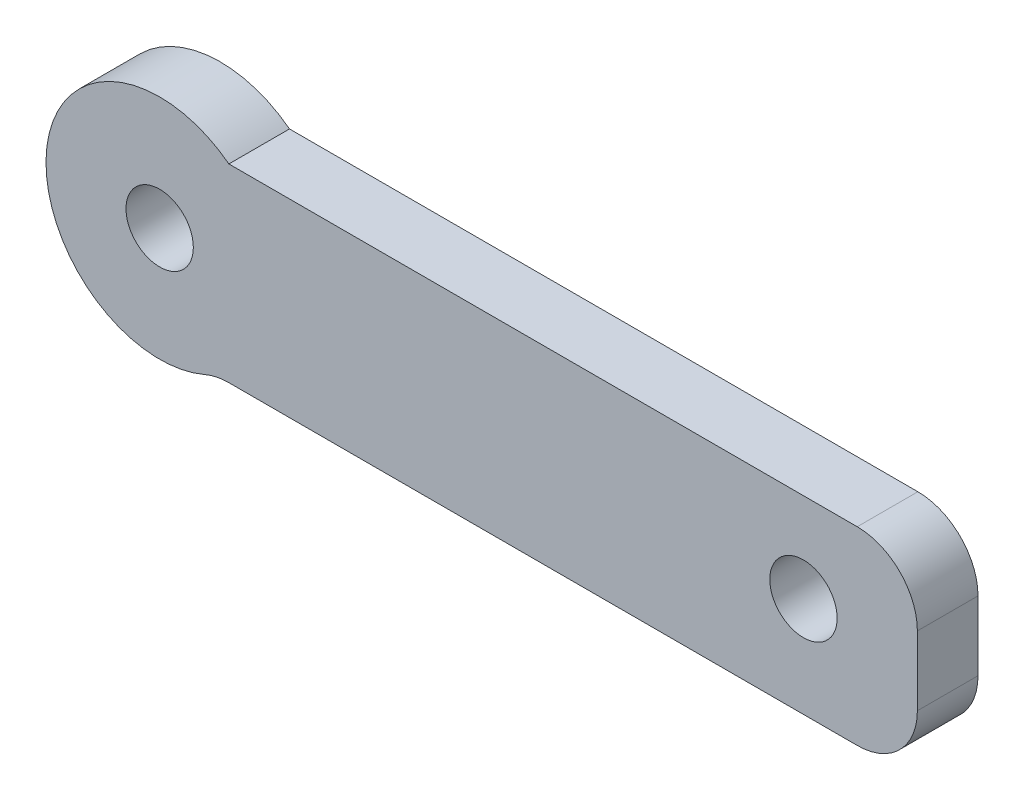
ISO-10303-21;
HEADER;
FILE_DESCRIPTION(('STEP AP214'),'2;1');
FILE_NAME('part.step','',(''),(''),'','','');
FILE_SCHEMA(('AUTOMOTIVE_DESIGN { 1 0 10303 214 1 1 1 1 }'));
ENDSEC;
DATA;
#1=APPLICATION_CONTEXT('core data for automotive mechanical design processes');
#2=APPLICATION_PROTOCOL_DEFINITION('international standard','automotive_design',2000,#1);
#3=PRODUCT_CONTEXT('',#1,'mechanical');
#4=PRODUCT('Part','Part','',(#3));
#5=PRODUCT_RELATED_PRODUCT_CATEGORY('part','',(#4));
#6=PRODUCT_DEFINITION_FORMATION('','',#4);
#7=PRODUCT_DEFINITION_CONTEXT('part definition',#1,'design');
#8=PRODUCT_DEFINITION('design','',#6,#7);
#9=PRODUCT_DEFINITION_SHAPE('','',#8);
#10=(LENGTH_UNIT() NAMED_UNIT(*) SI_UNIT(.MILLI.,.METRE.));
#11=(NAMED_UNIT(*) PLANE_ANGLE_UNIT() SI_UNIT($,.RADIAN.));
#12=(NAMED_UNIT(*) SI_UNIT($,.STERADIAN.) SOLID_ANGLE_UNIT());
#13=UNCERTAINTY_MEASURE_WITH_UNIT(LENGTH_MEASURE(1.E-05),#10,'distance_accuracy_value','');
#14=(GEOMETRIC_REPRESENTATION_CONTEXT(3) GLOBAL_UNCERTAINTY_ASSIGNED_CONTEXT((#13)) GLOBAL_UNIT_ASSIGNED_CONTEXT((#10,
#11,#12)) REPRESENTATION_CONTEXT('',''));
#15=CARTESIAN_POINT('',(0.,0.,0.));
#16=DIRECTION('',(0.,0.,1.));
#17=DIRECTION('',(1.,0.,0.));
#18=AXIS2_PLACEMENT_3D('',#15,#16,#17);
#19=CARTESIAN_POINT('',(1.82700523909868,-4.20799335863377,1.6002));
#20=DIRECTION('',(0.,0.,-1.));
#21=DIRECTION('',(-1.,0.,0.));
#22=AXIS2_PLACEMENT_3D('',#19,#20,#21);
#23=CYLINDRICAL_SURFACE('',#22,1.5875);
#24=CARTESIAN_POINT('',(1.82700523909868,-4.20799335863377,0.));
#25=DIRECTION('',(0.,0.,-1.));
#26=DIRECTION('',(1.,0.,0.));
#27=AXIS2_PLACEMENT_3D('',#24,#25,#26);
#28=CIRCLE('',#27,1.5875);
#29=CARTESIAN_POINT('',(1.19477181848415,-2.75182126995124,0.));
#30=VERTEX_POINT('',#29);
#31=CARTESIAN_POINT('',(1.82700523909868,-2.62049335863378,0.));
#32=VERTEX_POINT('',#31);
#33=EDGE_CURVE('E125',#30,#32,#28,.T.);
#34=ORIENTED_EDGE('',*,*,#33,.T.);
#35=DIRECTION('',(0.,0.,-1.));
#36=VECTOR('',#35,1.);
#37=CARTESIAN_POINT('',(1.82700523909868,-2.62049335863378,1.6002));
#38=LINE('',#37,#36);
#39=CARTESIAN_POINT('',(1.82700523909868,-2.62049335863378,1.6002));
#40=VERTEX_POINT('',#39);
#41=EDGE_CURVE('E11',#40,#32,#38,.T.);
#42=ORIENTED_EDGE('',*,*,#41,.F.);
#43=CARTESIAN_POINT('',(1.82700523909868,-4.20799335863377,1.6002));
#44=DIRECTION('',(0.,0.,-1.));
#45=DIRECTION('',(1.,0.,0.));
#46=AXIS2_PLACEMENT_3D('',#43,#44,#45);
#47=CIRCLE('',#46,1.5875);
#48=CARTESIAN_POINT('',(1.19477181848415,-2.75182126995124,1.6002));
#49=VERTEX_POINT('',#48);
#50=EDGE_CURVE('E137',#49,#40,#47,.T.);
#51=ORIENTED_EDGE('',*,*,#50,.F.);
#52=DIRECTION('',(0.,0.,-1.));
#53=VECTOR('',#52,1.);
#54=CARTESIAN_POINT('',(1.19477181848415,-2.75182126995124,1.6002));
#55=LINE('',#54,#53);
#56=EDGE_CURVE('E121',#49,#30,#55,.T.);
#57=ORIENTED_EDGE('',*,*,#56,.T.);
#58=EDGE_LOOP('',(#34,#42,#51,#57));
#59=FACE_BOUND('',#58,.T.);
#60=ADVANCED_FACE('F34',(#59),#23,.F.);
#61=CARTESIAN_POINT('',(1.82700523909868,-2.62049335863378,1.6002));
#62=DIRECTION('',(0.,1.,0.));
#63=DIRECTION('',(-1.,0.,0.));
#64=AXIS2_PLACEMENT_3D('',#61,#62,#63);
#65=PLANE('',#64);
#66=DIRECTION('',(1.,0.,0.));
#67=VECTOR('',#66,1.);
#68=CARTESIAN_POINT('',(1.82700523909868,-2.62049335863378,0.));
#69=LINE('',#68,#67);
#70=CARTESIAN_POINT('',(18.4125,-2.62049335863378,0.));
#71=VERTEX_POINT('',#70);
#72=EDGE_CURVE('E128',#32,#71,#69,.T.);
#73=ORIENTED_EDGE('',*,*,#72,.T.);
#74=DIRECTION('',(0.,0.,-1.));
#75=VECTOR('',#74,1.);
#76=CARTESIAN_POINT('',(18.4125,-2.62049335863378,1.6002));
#77=LINE('',#76,#75);
#78=CARTESIAN_POINT('',(18.4125,-2.62049335863378,1.6002));
#79=VERTEX_POINT('',#78);
#80=EDGE_CURVE('E43',#79,#71,#77,.T.);
#81=ORIENTED_EDGE('',*,*,#80,.F.);
#82=DIRECTION('',(1.,0.,0.));
#83=VECTOR('',#82,1.);
#84=CARTESIAN_POINT('',(1.82700523909868,-2.62049335863378,1.6002));
#85=LINE('',#84,#83);
#86=EDGE_CURVE('E91',#40,#79,#85,.T.);
#87=ORIENTED_EDGE('',*,*,#86,.F.);
#88=ORIENTED_EDGE('',*,*,#41,.T.);
#89=EDGE_LOOP('',(#73,#81,#87,#88));
#90=FACE_BOUND('',#89,.T.);
#91=ADVANCED_FACE('F190',(#90),#65,.F.);
#92=CARTESIAN_POINT('',(18.4125,-1.03299335863378,1.6002));
#93=DIRECTION('',(0.,0.,-1.));
#94=DIRECTION('',(-1.,0.,0.));
#95=AXIS2_PLACEMENT_3D('',#92,#93,#94);
#96=CYLINDRICAL_SURFACE('',#95,1.5875);
#97=CARTESIAN_POINT('',(18.4125,-1.03299335863378,0.));
#98=DIRECTION('',(0.,0.,1.));
#99=DIRECTION('',(1.,0.,0.));
#100=AXIS2_PLACEMENT_3D('',#97,#98,#99);
#101=CIRCLE('',#100,1.5875);
#102=CARTESIAN_POINT('',(20.,-1.03299335863378,0.));
#103=VERTEX_POINT('',#102);
#104=EDGE_CURVE('E130',#71,#103,#101,.T.);
#105=ORIENTED_EDGE('',*,*,#104,.T.);
#106=DIRECTION('',(0.,0.,-1.));
#107=VECTOR('',#106,1.);
#108=CARTESIAN_POINT('',(20.,-1.03299335863378,1.6002));
#109=LINE('',#108,#107);
#110=CARTESIAN_POINT('',(20.,-1.03299335863378,1.6002));
#111=VERTEX_POINT('',#110);
#112=EDGE_CURVE('E141',#111,#103,#109,.T.);
#113=ORIENTED_EDGE('',*,*,#112,.F.);
#114=CARTESIAN_POINT('',(18.4125,-1.03299335863378,1.6002));
#115=DIRECTION('',(0.,0.,1.));
#116=DIRECTION('',(1.,0.,0.));
#117=AXIS2_PLACEMENT_3D('',#114,#115,#116);
#118=CIRCLE('',#117,1.5875);
#119=EDGE_CURVE('E150',#79,#111,#118,.T.);
#120=ORIENTED_EDGE('',*,*,#119,.F.);
#121=ORIENTED_EDGE('',*,*,#80,.T.);
#122=EDGE_LOOP('',(#105,#113,#120,#121));
#123=FACE_BOUND('',#122,.T.);
#124=ADVANCED_FACE('F148',(#123),#96,.T.);
#125=CARTESIAN_POINT('',(20.,-1.03299335863378,1.6002));
#126=DIRECTION('',(-1.,0.,0.));
#127=DIRECTION('',(0.,-1.,0.));
#128=AXIS2_PLACEMENT_3D('',#125,#126,#127);
#129=PLANE('',#128);
#130=DIRECTION('',(0.,1.,0.));
#131=VECTOR('',#130,1.);
#132=CARTESIAN_POINT('',(20.,-1.03299335863378,0.));
#133=LINE('',#132,#131);
#134=CARTESIAN_POINT('',(20.,0.792006641366224,0.));
#135=VERTEX_POINT('',#134);
#136=EDGE_CURVE('E132',#103,#135,#133,.T.);
#137=ORIENTED_EDGE('',*,*,#136,.T.);
#138=DIRECTION('',(0.,0.,-1.));
#139=VECTOR('',#138,1.);
#140=CARTESIAN_POINT('',(20.,0.792006641366224,1.6002));
#141=LINE('',#140,#139);
#142=CARTESIAN_POINT('',(20.,0.792006641366224,1.6002));
#143=VERTEX_POINT('',#142);
#144=EDGE_CURVE('E116',#143,#135,#141,.T.);
#145=ORIENTED_EDGE('',*,*,#144,.F.);
#146=DIRECTION('',(0.,1.,0.));
#147=VECTOR('',#146,1.);
#148=CARTESIAN_POINT('',(20.,-1.03299335863378,1.6002));
#149=LINE('',#148,#147);
#150=EDGE_CURVE('E107',#111,#143,#149,.T.);
#151=ORIENTED_EDGE('',*,*,#150,.F.);
#152=ORIENTED_EDGE('',*,*,#112,.T.);
#153=EDGE_LOOP('',(#137,#145,#151,#152));
#154=FACE_BOUND('',#153,.T.);
#155=ADVANCED_FACE('F156',(#154),#129,.F.);
#156=CARTESIAN_POINT('',(18.4125,0.792006641366224,1.6002));
#157=DIRECTION('',(0.,0.,-1.));
#158=DIRECTION('',(-1.,0.,0.));
#159=AXIS2_PLACEMENT_3D('',#156,#157,#158);
#160=CYLINDRICAL_SURFACE('',#159,1.5875);
#161=CARTESIAN_POINT('',(18.4125,0.792006641366224,0.));
#162=DIRECTION('',(0.,0.,1.));
#163=DIRECTION('',(-1.,0.,0.));
#164=AXIS2_PLACEMENT_3D('',#161,#162,#163);
#165=CIRCLE('',#164,1.5875);
#166=CARTESIAN_POINT('',(18.4125,2.37950664136623,0.));
#167=VERTEX_POINT('',#166);
#168=EDGE_CURVE('E115',#135,#167,#165,.T.);
#169=ORIENTED_EDGE('',*,*,#168,.T.);
#170=DIRECTION('',(0.,0.,-1.));
#171=VECTOR('',#170,1.);
#172=CARTESIAN_POINT('',(18.4125,2.37950664136623,1.6002));
#173=LINE('',#172,#171);
#174=CARTESIAN_POINT('',(18.4125,2.37950664136623,1.6002));
#175=VERTEX_POINT('',#174);
#176=EDGE_CURVE('E112',#175,#167,#173,.T.);
#177=ORIENTED_EDGE('',*,*,#176,.F.);
#178=CARTESIAN_POINT('',(18.4125,0.792006641366224,1.6002));
#179=DIRECTION('',(0.,0.,1.));
#180=DIRECTION('',(-1.,0.,0.));
#181=AXIS2_PLACEMENT_3D('',#178,#179,#180);
#182=CIRCLE('',#181,1.5875);
#183=EDGE_CURVE('E101',#143,#175,#182,.T.);
#184=ORIENTED_EDGE('',*,*,#183,.F.);
#185=ORIENTED_EDGE('',*,*,#144,.T.);
#186=EDGE_LOOP('',(#169,#177,#184,#185));
#187=FACE_BOUND('',#186,.T.);
#188=ADVANCED_FACE('F113',(#187),#160,.T.);
#189=CARTESIAN_POINT('',(1.82700523909868,2.37950664136622,1.6002));
#190=DIRECTION('',(0.,-1.,0.));
#191=DIRECTION('',(1.,0.,0.));
#192=AXIS2_PLACEMENT_3D('',#189,#190,#191);
#193=PLANE('',#192);
#194=DIRECTION('',(-1.,0.,0.));
#195=VECTOR('',#194,1.);
#196=CARTESIAN_POINT('',(1.82700523909868,2.37950664136622,0.));
#197=LINE('',#196,#195);
#198=CARTESIAN_POINT('',(1.82700523909868,2.37950664136622,0.));
#199=VERTEX_POINT('',#198);
#200=EDGE_CURVE('E77',#167,#199,#197,.T.);
#201=ORIENTED_EDGE('',*,*,#200,.T.);
#202=DIRECTION('',(0.,0.,-1.));
#203=VECTOR('',#202,1.);
#204=CARTESIAN_POINT('',(1.82700523909868,2.37950664136622,1.6002));
#205=LINE('',#204,#203);
#206=CARTESIAN_POINT('',(1.82700523909868,2.37950664136622,1.6002));
#207=VERTEX_POINT('',#206);
#208=EDGE_CURVE('E117',#207,#199,#205,.T.);
#209=ORIENTED_EDGE('',*,*,#208,.F.);
#210=DIRECTION('',(-1.,0.,0.));
#211=VECTOR('',#210,1.);
#212=CARTESIAN_POINT('',(1.82700523909868,2.37950664136622,1.6002));
#213=LINE('',#212,#211);
#214=EDGE_CURVE('E105',#175,#207,#213,.T.);
#215=ORIENTED_EDGE('',*,*,#214,.F.);
#216=ORIENTED_EDGE('',*,*,#176,.T.);
#217=EDGE_LOOP('',(#201,#209,#215,#216));
#218=FACE_BOUND('',#217,.T.);
#219=ADVANCED_FACE('F119',(#218),#193,.F.);
#220=CARTESIAN_POINT('',(0.,0.,1.6002));
#221=DIRECTION('',(0.,0.,-1.));
#222=DIRECTION('',(-1.,0.,0.));
#223=AXIS2_PLACEMENT_3D('',#220,#221,#222);
#224=CYLINDRICAL_SURFACE('',#223,3.);
#225=CARTESIAN_POINT('',(0.,0.,0.));
#226=DIRECTION('',(0.,0.,1.));
#227=DIRECTION('',(1.,0.,0.));
#228=AXIS2_PLACEMENT_3D('',#225,#226,#227);
#229=CIRCLE('',#228,3.);
#230=EDGE_CURVE('E83',#199,#30,#229,.T.);
#231=ORIENTED_EDGE('',*,*,#230,.T.);
#232=ORIENTED_EDGE('',*,*,#56,.F.);
#233=CARTESIAN_POINT('',(0.,0.,1.6002));
#234=DIRECTION('',(0.,0.,1.));
#235=DIRECTION('',(1.,0.,0.));
#236=AXIS2_PLACEMENT_3D('',#233,#234,#235);
#237=CIRCLE('',#236,3.);
#238=EDGE_CURVE('E51',#207,#49,#237,.T.);
#239=ORIENTED_EDGE('',*,*,#238,.F.);
#240=ORIENTED_EDGE('',*,*,#208,.T.);
#241=EDGE_LOOP('',(#231,#232,#239,#240));
#242=FACE_BOUND('',#241,.T.);
#243=ADVANCED_FACE('F197',(#242),#224,.T.);
#244=CARTESIAN_POINT('',(1.82700523909868,-4.20799335863377,1.6002));
#245=DIRECTION('',(0.,0.,1.));
#246=DIRECTION('',(1.,0.,0.));
#247=AXIS2_PLACEMENT_3D('',#244,#245,#246);
#248=PLANE('',#247);
#249=CARTESIAN_POINT('',(16.9932188340461,0.0226560855687182,1.6002));
#250=DIRECTION('',(0.,0.,1.));
#251=DIRECTION('',(1.,0.,0.));
#252=AXIS2_PLACEMENT_3D('',#249,#250,#251);
#253=CIRCLE('',#252,0.888999999999914);
#254=CARTESIAN_POINT('',(17.882218834046,0.0226560855687182,1.6002));
#255=VERTEX_POINT('',#254);
#256=EDGE_CURVE('E164',#255,#255,#253,.T.);
#257=ORIENTED_EDGE('',*,*,#256,.F.);
#258=EDGE_LOOP('',(#257));
#259=FACE_BOUND('',#258,.T.);
#260=CARTESIAN_POINT('',(0.,0.,1.6002));
#261=DIRECTION('',(0.,0.,1.));
#262=DIRECTION('',(1.,0.,0.));
#263=AXIS2_PLACEMENT_3D('',#260,#261,#262);
#264=CIRCLE('',#263,0.888999999999943);
#265=CARTESIAN_POINT('',(0.888999999999943,0.,1.6002));
#266=VERTEX_POINT('',#265);
#267=EDGE_CURVE('E161',#266,#266,#264,.T.);
#268=ORIENTED_EDGE('',*,*,#267,.F.);
#269=EDGE_LOOP('',(#268));
#270=FACE_BOUND('',#269,.T.);
#271=ORIENTED_EDGE('',*,*,#50,.T.);
#272=ORIENTED_EDGE('',*,*,#86,.T.);
#273=ORIENTED_EDGE('',*,*,#119,.T.);
#274=ORIENTED_EDGE('',*,*,#150,.T.);
#275=ORIENTED_EDGE('',*,*,#183,.T.);
#276=ORIENTED_EDGE('',*,*,#214,.T.);
#277=ORIENTED_EDGE('',*,*,#238,.T.);
#278=EDGE_LOOP('',(#271,#272,#273,#274,#275,#276,#277));
#279=FACE_BOUND('',#278,.T.);
#280=ADVANCED_FACE('F103',(#259,#270,#279),#248,.T.);
#281=CARTESIAN_POINT('',(1.82700523909868,-4.20799335863377,0.));
#282=DIRECTION('',(0.,0.,1.));
#283=DIRECTION('',(1.,0.,0.));
#284=AXIS2_PLACEMENT_3D('',#281,#282,#283);
#285=PLANE('',#284);
#286=CARTESIAN_POINT('',(16.9932188340461,0.0226560855687182,0.));
#287=DIRECTION('',(0.,0.,-1.));
#288=DIRECTION('',(-1.,0.,0.));
#289=AXIS2_PLACEMENT_3D('',#286,#287,#288);
#290=CIRCLE('',#289,0.888999999999942);
#291=CARTESIAN_POINT('',(16.1042188340462,0.0226560855687182,0.));
#292=VERTEX_POINT('',#291);
#293=EDGE_CURVE('E167',#292,#292,#290,.T.);
#294=ORIENTED_EDGE('',*,*,#293,.F.);
#295=EDGE_LOOP('',(#294));
#296=FACE_BOUND('',#295,.T.);
#297=CARTESIAN_POINT('',(0.,0.,0.));
#298=DIRECTION('',(0.,0.,1.));
#299=DIRECTION('',(1.,0.,0.));
#300=AXIS2_PLACEMENT_3D('',#297,#298,#299);
#301=CIRCLE('',#300,0.888999999999914);
#302=CARTESIAN_POINT('',(0.888999999999914,0.,0.));
#303=VERTEX_POINT('',#302);
#304=EDGE_CURVE('E37',#303,#303,#301,.T.);
#305=ORIENTED_EDGE('',*,*,#304,.T.);
#306=EDGE_LOOP('',(#305));
#307=FACE_BOUND('',#306,.T.);
#308=ORIENTED_EDGE('',*,*,#33,.F.);
#309=ORIENTED_EDGE('',*,*,#230,.F.);
#310=ORIENTED_EDGE('',*,*,#200,.F.);
#311=ORIENTED_EDGE('',*,*,#168,.F.);
#312=ORIENTED_EDGE('',*,*,#136,.F.);
#313=ORIENTED_EDGE('',*,*,#104,.F.);
#314=ORIENTED_EDGE('',*,*,#72,.F.);
#315=EDGE_LOOP('',(#308,#309,#310,#311,#312,#313,#314));
#316=FACE_BOUND('',#315,.T.);
#317=ADVANCED_FACE('F154',(#296,#307,#316),#285,.F.);
#318=CARTESIAN_POINT('',(0.,0.,1.6002));
#319=DIRECTION('',(0.,0.,1.));
#320=DIRECTION('',(1.,0.,0.));
#321=AXIS2_PLACEMENT_3D('',#318,#319,#320);
#322=CYLINDRICAL_SURFACE('',#321,0.888999999999914);
#323=ORIENTED_EDGE('',*,*,#267,.T.);
#324=EDGE_LOOP('',(#323));
#325=FACE_BOUND('',#324,.T.);
#326=ORIENTED_EDGE('',*,*,#304,.F.);
#327=EDGE_LOOP('',(#326));
#328=FACE_BOUND('',#327,.T.);
#329=ADVANCED_FACE('F175',(#325,#328),#322,.F.);
#330=CARTESIAN_POINT('',(16.9932188340461,0.0226560855687182,0.));
#331=DIRECTION('',(0.,0.,-1.));
#332=DIRECTION('',(-1.,0.,0.));
#333=AXIS2_PLACEMENT_3D('',#330,#331,#332);
#334=CYLINDRICAL_SURFACE('',#333,0.888999999999914);
#335=ORIENTED_EDGE('',*,*,#256,.T.);
#336=EDGE_LOOP('',(#335));
#337=FACE_BOUND('',#336,.T.);
#338=ORIENTED_EDGE('',*,*,#293,.T.);
#339=EDGE_LOOP('',(#338));
#340=FACE_BOUND('',#339,.T.);
#341=ADVANCED_FACE('F171',(#337,#340),#334,.F.);
#342=CLOSED_SHELL('',(#60,#91,#124,#155,#188,#219,#243,#280,#317,#329,#341));
#343=MANIFOLD_SOLID_BREP('B2',#342);
#344=ADVANCED_BREP_SHAPE_REPRESENTATION('',(#18,#343),#14);
#345=SHAPE_DEFINITION_REPRESENTATION(#9,#344);
ENDSEC;
END-ISO-10303-21;
